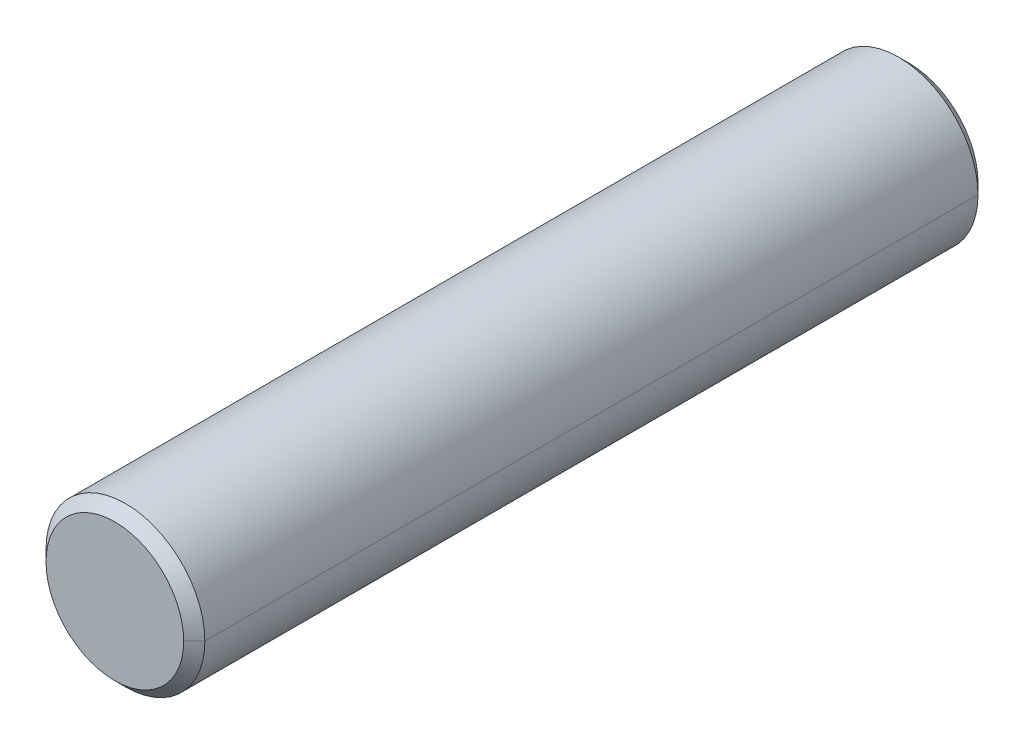
ISO-10303-21;
HEADER;
FILE_DESCRIPTION(('STEP AP214'),'2;1');
FILE_NAME('part.step','',(''),(''),'','','');
FILE_SCHEMA(('AUTOMOTIVE_DESIGN { 1 0 10303 214 1 1 1 1 }'));
ENDSEC;
DATA;
#1=APPLICATION_CONTEXT('core data for automotive mechanical design processes');
#2=APPLICATION_PROTOCOL_DEFINITION('international standard','automotive_design',2000,#1);
#3=PRODUCT_CONTEXT('',#1,'mechanical');
#4=PRODUCT('Part','Part','',(#3));
#5=PRODUCT_RELATED_PRODUCT_CATEGORY('part','',(#4));
#6=PRODUCT_DEFINITION_FORMATION('','',#4);
#7=PRODUCT_DEFINITION_CONTEXT('part definition',#1,'design');
#8=PRODUCT_DEFINITION('design','',#6,#7);
#9=PRODUCT_DEFINITION_SHAPE('','',#8);
#10=(LENGTH_UNIT() NAMED_UNIT(*) SI_UNIT(.MILLI.,.METRE.));
#11=(NAMED_UNIT(*) PLANE_ANGLE_UNIT() SI_UNIT($,.RADIAN.));
#12=(NAMED_UNIT(*) SI_UNIT($,.STERADIAN.) SOLID_ANGLE_UNIT());
#13=UNCERTAINTY_MEASURE_WITH_UNIT(LENGTH_MEASURE(1.E-05),#10,'distance_accuracy_value','');
#14=(GEOMETRIC_REPRESENTATION_CONTEXT(3) GLOBAL_UNCERTAINTY_ASSIGNED_CONTEXT((#13)) GLOBAL_UNIT_ASSIGNED_CONTEXT((#10,
#11,#12)) REPRESENTATION_CONTEXT('',''));
#15=CARTESIAN_POINT('',(0.,0.,0.));
#16=DIRECTION('',(0.,0.,1.));
#17=DIRECTION('',(1.,0.,0.));
#18=AXIS2_PLACEMENT_3D('',#15,#16,#17);
#19=CARTESIAN_POINT('',(0.,0.,-75.));
#20=DIRECTION('',(0.,0.,1.));
#21=DIRECTION('',(1.,0.,0.));
#22=AXIS2_PLACEMENT_3D('',#19,#20,#21);
#23=PLANE('',#22);
#24=CARTESIAN_POINT('',(0.,0.,-75.));
#25=DIRECTION('',(0.,0.,-1.));
#26=DIRECTION('',(-1.,0.,0.));
#27=AXIS2_PLACEMENT_3D('',#24,#25,#26);
#28=CIRCLE('',#27,13.);
#29=CARTESIAN_POINT('',(-12.9999999991568,-5.42566200191955E-08,-75.0000000008432));
#30=VERTEX_POINT('',#29);
#31=CARTESIAN_POINT('',(12.9999999991568,5.42566206812047E-08,-75.0000000008432));
#32=VERTEX_POINT('',#31);
#33=EDGE_CURVE('E11',#30,#32,#28,.T.);
#34=ORIENTED_EDGE('',*,*,#33,.T.);
#35=CARTESIAN_POINT('',(0.,0.,-75.));
#36=DIRECTION('',(0.,0.,-1.));
#37=DIRECTION('',(1.,0.,0.));
#38=AXIS2_PLACEMENT_3D('',#35,#36,#37);
#39=CIRCLE('',#38,13.);
#40=EDGE_CURVE('E27',#32,#30,#39,.T.);
#41=ORIENTED_EDGE('',*,*,#40,.T.);
#42=EDGE_LOOP('',(#34,#41));
#43=FACE_BOUND('',#42,.T.);
#44=ADVANCED_FACE('F16',(#43),#23,.F.);
#45=CARTESIAN_POINT('',(0.,0.,-87.));
#46=DIRECTION('',(0.,0.,1.));
#47=DIRECTION('',(0.,-1.,0.));
#48=AXIS2_PLACEMENT_3D('',#45,#46,#47);
#49=CONICAL_SURFACE('',#48,1.,0.785398163397448);
#50=DIRECTION('',(-0.707106781186546,-8.85351321860765E-09,0.707106781186549));
#51=VECTOR('',#50,1.);
#52=CARTESIAN_POINT('',(-12.9999999974705,-1.62769860057587E-07,-75.0000000025295));
#53=LINE('',#52,#51);
#54=CARTESIAN_POINT('',(-14.9999999992703,-4.69528428696531E-08,-73.0000000007297));
#55=VERTEX_POINT('',#54);
#56=EDGE_CURVE('E83',#30,#55,#53,.T.);
#57=ORIENTED_EDGE('',*,*,#56,.T.);
#58=CARTESIAN_POINT('',(0.,0.,-73.));
#59=DIRECTION('',(0.,0.,-1.));
#60=DIRECTION('',(-1.,0.,0.));
#61=AXIS2_PLACEMENT_3D('',#58,#59,#60);
#62=CIRCLE('',#61,15.);
#63=CARTESIAN_POINT('',(14.9999999992703,4.69528434425457E-08,-73.0000000007297));
#64=VERTEX_POINT('',#63);
#65=EDGE_CURVE('E87',#55,#64,#62,.T.);
#66=ORIENTED_EDGE('',*,*,#65,.T.);
#67=DIRECTION('',(0.707106781186546,8.85351267716626E-09,0.707106781186549));
#68=VECTOR('',#67,1.);
#69=CARTESIAN_POINT('',(12.9999999974705,1.62769862043614E-07,-75.0000000025295));
#70=LINE('',#69,#68);
#71=EDGE_CURVE('E92',#32,#64,#70,.T.);
#72=ORIENTED_EDGE('',*,*,#71,.F.);
#73=ORIENTED_EDGE('',*,*,#33,.F.);
#74=EDGE_LOOP('',(#57,#66,#72,#73));
#75=FACE_BOUND('',#74,.T.);
#76=ADVANCED_FACE('F124',(#75),#49,.T.);
#77=CARTESIAN_POINT('',(0.,0.,-87.));
#78=DIRECTION('',(0.,0.,1.));
#79=DIRECTION('',(0.,-1.,0.));
#80=AXIS2_PLACEMENT_3D('',#77,#78,#79);
#81=CONICAL_SURFACE('',#80,1.,0.785398163397448);
#82=ORIENTED_EDGE('',*,*,#71,.T.);
#83=CARTESIAN_POINT('',(0.,0.,-73.));
#84=DIRECTION('',(0.,0.,-1.));
#85=DIRECTION('',(1.,0.,0.));
#86=AXIS2_PLACEMENT_3D('',#83,#84,#85);
#87=CIRCLE('',#86,15.);
#88=EDGE_CURVE('E94',#64,#55,#87,.T.);
#89=ORIENTED_EDGE('',*,*,#88,.T.);
#90=ORIENTED_EDGE('',*,*,#56,.F.);
#91=ORIENTED_EDGE('',*,*,#40,.F.);
#92=EDGE_LOOP('',(#82,#89,#90,#91));
#93=FACE_BOUND('',#92,.T.);
#94=ADVANCED_FACE('F125',(#93),#81,.T.);
#95=CARTESIAN_POINT('',(0.,0.,-75.));
#96=DIRECTION('',(0.,0.,-1.));
#97=DIRECTION('',(1.,0.,0.));
#98=AXIS2_PLACEMENT_3D('',#95,#96,#97);
#99=CYLINDRICAL_SURFACE('',#98,15.);
#100=DIRECTION('',(0.,0.,1.));
#101=VECTOR('',#100,1.);
#102=CARTESIAN_POINT('',(15.,0.,-73.));
#103=LINE('',#102,#101);
#104=CARTESIAN_POINT('',(14.9999999995768,-4.32072838948757E-08,73.0000000004232));
#105=VERTEX_POINT('',#104);
#106=EDGE_CURVE('E69',#64,#105,#103,.T.);
#107=ORIENTED_EDGE('',*,*,#106,.F.);
#108=ORIENTED_EDGE('',*,*,#65,.F.);
#109=DIRECTION('',(0.,0.,1.));
#110=VECTOR('',#109,1.);
#111=CARTESIAN_POINT('',(-15.,0.,-73.));
#112=LINE('',#111,#110);
#113=CARTESIAN_POINT('',(-14.9999999995768,4.32072852146178E-08,73.0000000004232));
#114=VERTEX_POINT('',#113);
#115=EDGE_CURVE('E98',#55,#114,#112,.T.);
#116=ORIENTED_EDGE('',*,*,#115,.T.);
#117=CARTESIAN_POINT('',(0.,0.,73.));
#118=DIRECTION('',(0.,0.,1.));
#119=DIRECTION('',(1.,0.,0.));
#120=AXIS2_PLACEMENT_3D('',#117,#118,#119);
#121=CIRCLE('',#120,15.);
#122=EDGE_CURVE('E70',#105,#114,#121,.T.);
#123=ORIENTED_EDGE('',*,*,#122,.F.);
#124=EDGE_LOOP('',(#107,#108,#116,#123));
#125=FACE_BOUND('',#124,.T.);
#126=ADVANCED_FACE('F121',(#125),#99,.T.);
#127=CARTESIAN_POINT('',(0.,0.,-75.));
#128=DIRECTION('',(0.,0.,-1.));
#129=DIRECTION('',(1.,0.,0.));
#130=AXIS2_PLACEMENT_3D('',#127,#128,#129);
#131=CYLINDRICAL_SURFACE('',#130,15.);
#132=ORIENTED_EDGE('',*,*,#115,.F.);
#133=ORIENTED_EDGE('',*,*,#88,.F.);
#134=ORIENTED_EDGE('',*,*,#106,.T.);
#135=CARTESIAN_POINT('',(0.,0.,73.));
#136=DIRECTION('',(0.,0.,1.));
#137=DIRECTION('',(-1.,0.,0.));
#138=AXIS2_PLACEMENT_3D('',#135,#136,#137);
#139=CIRCLE('',#138,15.);
#140=EDGE_CURVE('E64',#114,#105,#139,.T.);
#141=ORIENTED_EDGE('',*,*,#140,.F.);
#142=EDGE_LOOP('',(#132,#133,#134,#141));
#143=FACE_BOUND('',#142,.T.);
#144=ADVANCED_FACE('F119',(#143),#131,.T.);
#145=CARTESIAN_POINT('',(0.,0.,87.));
#146=DIRECTION('',(0.,0.,-1.));
#147=DIRECTION('',(0.,-1.,0.));
#148=AXIS2_PLACEMENT_3D('',#145,#146,#147);
#149=CONICAL_SURFACE('',#148,1.,0.785398163397448);
#150=DIRECTION('',(0.707106781186547,-8.14724137026633E-09,-0.707106781186548));
#151=VECTOR('',#150,1.);
#152=CARTESIAN_POINT('',(12.999999998533,-1.49785253424647E-07,75.000000001467));
#153=LINE('',#152,#151);
#154=CARTESIAN_POINT('',(12.999999999511,-4.99284178082158E-08,75.000000000489));
#155=VERTEX_POINT('',#154);
#156=EDGE_CURVE('E57',#155,#105,#153,.T.);
#157=ORIENTED_EDGE('',*,*,#156,.T.);
#158=ORIENTED_EDGE('',*,*,#122,.T.);
#159=DIRECTION('',(-0.707106781186547,8.14724301077243E-09,-0.707106781186548));
#160=VECTOR('',#159,1.);
#161=CARTESIAN_POINT('',(-12.999999998533,1.49785252226593E-07,75.000000001467));
#162=LINE('',#161,#160);
#163=CARTESIAN_POINT('',(-12.999999999511,4.99284174088644E-08,75.000000000489));
#164=VERTEX_POINT('',#163);
#165=EDGE_CURVE('E59',#164,#114,#162,.T.);
#166=ORIENTED_EDGE('',*,*,#165,.F.);
#167=CARTESIAN_POINT('',(0.,0.,75.));
#168=DIRECTION('',(0.,0.,1.));
#169=DIRECTION('',(1.,0.,0.));
#170=AXIS2_PLACEMENT_3D('',#167,#168,#169);
#171=CIRCLE('',#170,13.);
#172=EDGE_CURVE('E20',#155,#164,#171,.T.);
#173=ORIENTED_EDGE('',*,*,#172,.F.);
#174=EDGE_LOOP('',(#157,#158,#166,#173));
#175=FACE_BOUND('',#174,.T.);
#176=ADVANCED_FACE('F55',(#175),#149,.T.);
#177=CARTESIAN_POINT('',(0.,0.,87.));
#178=DIRECTION('',(0.,0.,-1.));
#179=DIRECTION('',(0.,-1.,0.));
#180=AXIS2_PLACEMENT_3D('',#177,#178,#179);
#181=CONICAL_SURFACE('',#180,1.,0.785398163397448);
#182=ORIENTED_EDGE('',*,*,#165,.T.);
#183=ORIENTED_EDGE('',*,*,#140,.T.);
#184=ORIENTED_EDGE('',*,*,#156,.F.);
#185=CARTESIAN_POINT('',(0.,0.,75.));
#186=DIRECTION('',(0.,0.,1.));
#187=DIRECTION('',(-1.,0.,0.));
#188=AXIS2_PLACEMENT_3D('',#185,#186,#187);
#189=CIRCLE('',#188,13.);
#190=EDGE_CURVE('E65',#164,#155,#189,.T.);
#191=ORIENTED_EDGE('',*,*,#190,.F.);
#192=EDGE_LOOP('',(#182,#183,#184,#191));
#193=FACE_BOUND('',#192,.T.);
#194=ADVANCED_FACE('F18',(#193),#181,.T.);
#195=CARTESIAN_POINT('',(0.,0.,75.));
#196=DIRECTION('',(0.,0.,1.));
#197=DIRECTION('',(1.,0.,0.));
#198=AXIS2_PLACEMENT_3D('',#195,#196,#197);
#199=PLANE('',#198);
#200=ORIENTED_EDGE('',*,*,#172,.T.);
#201=ORIENTED_EDGE('',*,*,#190,.T.);
#202=EDGE_LOOP('',(#200,#201));
#203=FACE_BOUND('',#202,.T.);
#204=ADVANCED_FACE('F72',(#203),#199,.T.);
#205=CLOSED_SHELL('',(#44,#76,#94,#126,#144,#176,#194,#204));
#206=MANIFOLD_SOLID_BREP('B1',#205);
#207=ADVANCED_BREP_SHAPE_REPRESENTATION('',(#18,#206),#14);
#208=SHAPE_DEFINITION_REPRESENTATION(#9,#207);
ENDSEC;
END-ISO-10303-21;
